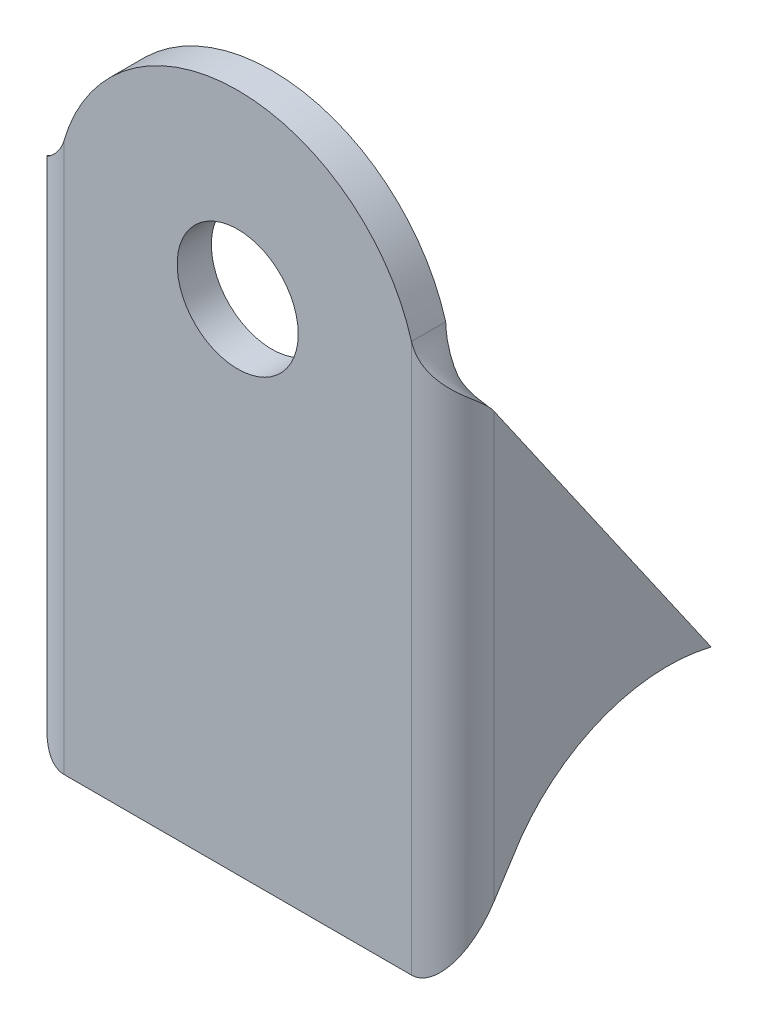
ISO-10303-21;
HEADER;
FILE_DESCRIPTION(('STEP AP214'),'2;1');
FILE_NAME('part.step','',(''),(''),'','','');
FILE_SCHEMA(('AUTOMOTIVE_DESIGN { 1 0 10303 214 1 1 1 1 }'));
ENDSEC;
DATA;
#1=APPLICATION_CONTEXT('core data for automotive mechanical design processes');
#2=APPLICATION_PROTOCOL_DEFINITION('international standard','automotive_design',2000,#1);
#3=PRODUCT_CONTEXT('',#1,'mechanical');
#4=PRODUCT('Part','Part','',(#3));
#5=PRODUCT_RELATED_PRODUCT_CATEGORY('part','',(#4));
#6=PRODUCT_DEFINITION_FORMATION('','',#4);
#7=PRODUCT_DEFINITION_CONTEXT('part definition',#1,'design');
#8=PRODUCT_DEFINITION('design','',#6,#7);
#9=PRODUCT_DEFINITION_SHAPE('','',#8);
#10=(LENGTH_UNIT() NAMED_UNIT(*) SI_UNIT(.MILLI.,.METRE.));
#11=(NAMED_UNIT(*) PLANE_ANGLE_UNIT() SI_UNIT($,.RADIAN.));
#12=(NAMED_UNIT(*) SI_UNIT($,.STERADIAN.) SOLID_ANGLE_UNIT());
#13=UNCERTAINTY_MEASURE_WITH_UNIT(LENGTH_MEASURE(1.E-05),#10,'distance_accuracy_value','');
#14=(GEOMETRIC_REPRESENTATION_CONTEXT(3) GLOBAL_UNCERTAINTY_ASSIGNED_CONTEXT((#13)) GLOBAL_UNIT_ASSIGNED_CONTEXT((#10,
#11,#12)) REPRESENTATION_CONTEXT('',''));
#15=CARTESIAN_POINT('',(0.,0.,0.));
#16=DIRECTION('',(0.,0.,1.));
#17=DIRECTION('',(1.,0.,0.));
#18=AXIS2_PLACEMENT_3D('',#15,#16,#17);
#19=CARTESIAN_POINT('',(0.,35.,15.1));
#20=DIRECTION('',(0.,0.,1.));
#21=DIRECTION('',(1.,0.,0.));
#22=AXIS2_PLACEMENT_3D('',#19,#20,#21);
#23=CYLINDRICAL_SURFACE('',#22,12.7);
#24=CARTESIAN_POINT('',(12.2,38.5284557528755,12.7));
#25=CARTESIAN_POINT('',(12.2,38.5284557528755,15.1));
#26=B_SPLINE_CURVE_WITH_KNOTS('',1,(#24,#25),.UNSPECIFIED.,.F.,.F.,(2,2),(0.,1.),.UNSPECIFIED.);
#27=CARTESIAN_POINT('',(12.2,38.5284557528755,12.7));
#28=VERTEX_POINT('',#27);
#29=CARTESIAN_POINT('',(12.2,38.5284557528755,15.1));
#30=VERTEX_POINT('',#29);
#31=EDGE_CURVE('E12',#28,#30,#26,.T.);
#32=ORIENTED_EDGE('',*,*,#31,.F.);
#33=CARTESIAN_POINT('',(0.,35.,12.7));
#34=DIRECTION('',(0.,0.,1.));
#35=DIRECTION('',(1.,0.,0.));
#36=AXIS2_PLACEMENT_3D('',#33,#34,#35);
#37=CIRCLE('',#36,12.7);
#38=CARTESIAN_POINT('',(-12.2,38.5284557528755,12.7));
#39=VERTEX_POINT('',#38);
#40=EDGE_CURVE('E105',#28,#39,#37,.T.);
#41=ORIENTED_EDGE('',*,*,#40,.T.);
#42=CARTESIAN_POINT('',(-12.2,38.5284557528755,15.1));
#43=CARTESIAN_POINT('',(-12.2,38.5284557528755,12.7));
#44=B_SPLINE_CURVE_WITH_KNOTS('',1,(#42,#43),.UNSPECIFIED.,.F.,.F.,(2,2),(0.,1.),.UNSPECIFIED.);
#45=CARTESIAN_POINT('',(-12.2,38.5284557528755,15.1));
#46=VERTEX_POINT('',#45);
#47=EDGE_CURVE('E56',#39,#46,#44,.F.);
#48=ORIENTED_EDGE('',*,*,#47,.T.);
#49=CARTESIAN_POINT('',(0.,35.,15.1));
#50=DIRECTION('',(0.,0.,1.));
#51=DIRECTION('',(-1.,0.,0.));
#52=AXIS2_PLACEMENT_3D('',#49,#50,#51);
#53=CIRCLE('',#52,12.7);
#54=EDGE_CURVE('E107',#30,#46,#53,.T.);
#55=ORIENTED_EDGE('',*,*,#54,.F.);
#56=EDGE_LOOP('',(#32,#41,#48,#55));
#57=FACE_BOUND('',#56,.T.);
#58=ADVANCED_FACE('F45',(#57),#23,.T.);
#59=CARTESIAN_POINT('',(-15.1,34.2798992341935,12.2));
#60=CARTESIAN_POINT('',(-15.1,34.4819461582793,12.3402907299088));
#61=CARTESIAN_POINT('',(-15.0896251809378,34.6704199315726,12.5085310570541));
#62=CARTESIAN_POINT('',(-15.0258753157223,35.0277931694172,12.8779039751087));
#63=CARTESIAN_POINT('',(-14.9722096248799,35.1967496451291,13.0789694076133));
#64=CARTESIAN_POINT('',(-14.8092263521637,35.5231163699395,13.4843952923347));
#65=CARTESIAN_POINT('',(-14.6997974551834,35.6805266190379,13.6884702876476));
#66=CARTESIAN_POINT('',(-14.4294183143129,35.9917149504285,14.0692846476547));
#67=CARTESIAN_POINT('',(-14.2685979653156,36.1454930327207,14.2457210777238));
#68=CARTESIAN_POINT('',(-13.9161941700124,36.4573310903059,14.5492019582757));
#69=CARTESIAN_POINT('',(-13.7249074025649,36.6153910655989,14.6761076228356));
#70=CARTESIAN_POINT('',(-13.3421307857591,36.943706968993,14.8743202527901));
#71=CARTESIAN_POINT('',(-13.1509263013254,37.1139628970942,14.9457318374617));
#72=CARTESIAN_POINT('',(-12.6233593866597,37.6548957003203,15.0920552285424));
#73=CARTESIAN_POINT('',(-12.3365990106616,38.0561505727088,15.1));
#74=CARTESIAN_POINT('',(-12.2,38.5284557528755,15.1));
#75=CARTESIAN_POINT('',(-12.7,34.2798992341935,12.2));
#76=CARTESIAN_POINT('',(-12.7,34.4820006931203,12.2241945855218));
#77=CARTESIAN_POINT('',(-12.6982112380927,34.6704199315726,12.2531950098369));
#78=CARTESIAN_POINT('',(-12.6872198820211,35.0277931694172,12.3168799957084));
#79=CARTESIAN_POINT('',(-12.6779671767034,35.1967496451291,12.3515464495885));
#80=CARTESIAN_POINT('',(-12.649866612442,35.5231163699395,12.4214474641956));
#81=CARTESIAN_POINT('',(-12.6309995612385,35.6805266190379,12.4566328082151));
#82=CARTESIAN_POINT('',(-12.584382467985,35.9917149504285,12.5222904564922));
#83=CARTESIAN_POINT('',(-12.5566548216061,36.1454930327207,12.552710530642));
#84=CARTESIAN_POINT('',(-12.4958955465539,36.4573310903059,12.6050348203924));
#85=CARTESIAN_POINT('',(-12.4629150694077,36.6153910655989,12.6269151073854));
#86=CARTESIAN_POINT('',(-12.3969191009929,36.943706968993,12.6610896987569));
#87=CARTESIAN_POINT('',(-12.3639528105733,37.1139628970942,12.6734020409417));
#88=CARTESIAN_POINT('',(-12.2729929976999,37.6548957003203,12.6986302118176));
#89=CARTESIAN_POINT('',(-12.2235714850513,38.0557508646616,12.7));
#90=CARTESIAN_POINT('',(-12.2,38.5284557528755,12.7));
#91=B_SPLINE_SURFACE_WITH_KNOTS('',1,3,((#59,#60,#61,#62,#63,#64,#65,#66,#67,#68,#69,#70,#71,
#72,#73,#74),(#75,#76,#77,#78,#79,#80,#81,#82,#83,#84,#85,#86,#87,#88,#89,#90)),.UNSPECIFIED.,
.F.,.F.,.F.,(2,2),(4,2,2,2,2,2,2,4),(0.,1.),(0.,0.125,0.25,0.375,0.5,0.625,0.75,1.),.UNSPECIFIED.);
#92=CARTESIAN_POINT('',(-12.2,38.5284557528755,12.7));
#93=CARTESIAN_POINT('',(-12.2235714850513,38.0557508646616,12.7));
#94=CARTESIAN_POINT('',(-12.2729929976999,37.6548957003203,12.6986302118176));
#95=CARTESIAN_POINT('',(-12.3639528105733,37.1139628970942,12.6734020409417));
#96=CARTESIAN_POINT('',(-12.3969191009929,36.943706968993,12.6610896987569));
#97=CARTESIAN_POINT('',(-12.4629150694077,36.6153910655989,12.6269151073854));
#98=CARTESIAN_POINT('',(-12.4958955465539,36.4573310903059,12.6050348203924));
#99=CARTESIAN_POINT('',(-12.5566548216061,36.1454930327207,12.552710530642));
#100=CARTESIAN_POINT('',(-12.584382467985,35.9917149504285,12.5222904564922));
#101=CARTESIAN_POINT('',(-12.6309995612385,35.6805266190379,12.4566328082151));
#102=CARTESIAN_POINT('',(-12.649866612442,35.5231163699395,12.4214474641956));
#103=CARTESIAN_POINT('',(-12.6779671767034,35.1967496451291,12.3515464495885));
#104=CARTESIAN_POINT('',(-12.6872198820211,35.0277931694172,12.3168799957084));
#105=CARTESIAN_POINT('',(-12.6982112380927,34.6704199315726,12.2531950098369));
#106=CARTESIAN_POINT('',(-12.7,34.4820006931203,12.2241945855218));
#107=CARTESIAN_POINT('',(-12.7,34.2798992341935,12.2));
#108=B_SPLINE_CURVE_WITH_KNOTS('',3,(#92,#93,#94,#95,#96,#97,#98,#99,#100,#101,#102,#103,#104,
#105,#106,#107),.UNSPECIFIED.,.F.,.F.,(4,2,2,2,2,2,2,4),(0.,0.25,0.375,0.5,0.625,0.75,0.875,1.),.UNSPECIFIED.);
#109=CARTESIAN_POINT('',(-12.7,34.2798992341935,12.2));
#110=VERTEX_POINT('',#109);
#111=EDGE_CURVE('E272',#39,#110,#108,.T.);
#112=CARTESIAN_POINT('',(-12.7,34.2798992341935,12.2));
#113=CARTESIAN_POINT('',(-15.1,34.2798992341935,12.2));
#114=B_SPLINE_CURVE_WITH_KNOTS('',1,(#112,#113),.UNSPECIFIED.,.F.,.F.,(2,2),(0.,1.),.UNSPECIFIED.);
#115=CARTESIAN_POINT('',(-15.1,34.2798992341935,12.2));
#116=VERTEX_POINT('',#115);
#117=EDGE_CURVE('E240',#110,#116,#114,.T.);
#118=CARTESIAN_POINT('',(-15.1,34.2798992341935,12.2));
#119=CARTESIAN_POINT('',(-15.1,34.4819461582793,12.3402907299088));
#120=CARTESIAN_POINT('',(-15.0896251809378,34.6704199315726,12.5085310570541));
#121=CARTESIAN_POINT('',(-15.0258753157223,35.0277931694172,12.8779039751087));
#122=CARTESIAN_POINT('',(-14.9722096248799,35.1967496451291,13.0789694076133));
#123=CARTESIAN_POINT('',(-14.8092263521637,35.5231163699395,13.4843952923347));
#124=CARTESIAN_POINT('',(-14.6997974551834,35.6805266190379,13.6884702876476));
#125=CARTESIAN_POINT('',(-14.4294183143129,35.9917149504285,14.0692846476547));
#126=CARTESIAN_POINT('',(-14.2685979653156,36.1454930327207,14.2457210777238));
#127=CARTESIAN_POINT('',(-13.9161941700124,36.4573310903059,14.5492019582757));
#128=CARTESIAN_POINT('',(-13.7249074025649,36.6153910655989,14.6761076228356));
#129=CARTESIAN_POINT('',(-13.3421307857591,36.943706968993,14.8743202527901));
#130=CARTESIAN_POINT('',(-13.1509263013254,37.1139628970942,14.9457318374617));
#131=CARTESIAN_POINT('',(-12.6233593866597,37.6548957003203,15.0920552285424));
#132=CARTESIAN_POINT('',(-12.3365990106616,38.0561505727088,15.1));
#133=CARTESIAN_POINT('',(-12.2,38.5284557528755,15.1));
#134=B_SPLINE_CURVE_WITH_KNOTS('',3,(#118,#119,#120,#121,#122,#123,#124,#125,#126,#127,#128,
#129,#130,#131,#132,#133),.UNSPECIFIED.,.F.,.F.,(4,2,2,2,2,2,2,4),(0.,0.125,0.25,0.375,0.5,
0.625,0.75,1.),.UNSPECIFIED.);
#135=EDGE_CURVE('E336',#46,#116,#134,.F.);
#136=ORIENTED_EDGE('',*,*,#47,.F.);
#137=ORIENTED_EDGE('',*,*,#111,.T.);
#138=ORIENTED_EDGE('',*,*,#117,.T.);
#139=ORIENTED_EDGE('',*,*,#135,.F.);
#140=EDGE_LOOP('',(#136,#137,#138,#139));
#141=FACE_BOUND('',#140,.T.);
#142=ADVANCED_FACE('F193',(#141),#91,.F.);
#143=CARTESIAN_POINT('',(-15.1,35.,12.7));
#144=DIRECTION('',(0.,0.570341957284981,-0.821407360424982));
#145=DIRECTION('',(0.,-0.821407360424982,-0.570341957284981));
#146=AXIS2_PLACEMENT_3D('',#143,#144,#145);
#147=PLANE('',#146);
#148=ORIENTED_EDGE('',*,*,#117,.F.);
#149=DIRECTION('',(0.,-0.821407360424982,-0.570341957284981));
#150=VECTOR('',#149,1.);
#151=CARTESIAN_POINT('',(-12.7,35.,12.7));
#152=LINE('',#151,#150);
#153=CARTESIAN_POINT('',(-12.7,12.3307004309584,-3.04036624141937));
#154=VERTEX_POINT('',#153);
#155=EDGE_CURVE('E258',#110,#154,#152,.T.);
#156=ORIENTED_EDGE('',*,*,#155,.T.);
#157=DIRECTION('',(-1.,0.,0.));
#158=VECTOR('',#157,1.);
#159=CARTESIAN_POINT('',(-15.1,12.3307004309584,-3.04036624141937));
#160=LINE('',#159,#158);
#161=CARTESIAN_POINT('',(-15.1,12.3307004309584,-3.04036624141937));
#162=VERTEX_POINT('',#161);
#163=EDGE_CURVE('E266',#154,#162,#160,.T.);
#164=ORIENTED_EDGE('',*,*,#163,.T.);
#165=DIRECTION('',(0.,-0.821407360424982,-0.570341957284981));
#166=VECTOR('',#165,1.);
#167=CARTESIAN_POINT('',(-15.1,35.,12.7));
#168=LINE('',#167,#166);
#169=EDGE_CURVE('E261',#116,#162,#168,.T.);
#170=ORIENTED_EDGE('',*,*,#169,.F.);
#171=EDGE_LOOP('',(#148,#156,#164,#170));
#172=FACE_BOUND('',#171,.T.);
#173=ADVANCED_FACE('F204',(#172),#147,.T.);
#174=CARTESIAN_POINT('',(-15.1,0.,0.));
#175=DIRECTION('',(1.,0.,0.));
#176=DIRECTION('',(0.,0.,-1.));
#177=AXIS2_PLACEMENT_3D('',#174,#175,#176);
#178=CYLINDRICAL_SURFACE('',#177,12.7);
#179=ORIENTED_EDGE('',*,*,#163,.F.);
#180=CARTESIAN_POINT('',(-12.7,0.,0.));
#181=DIRECTION('',(1.,0.,0.));
#182=DIRECTION('',(0.,0.,-1.));
#183=AXIS2_PLACEMENT_3D('',#180,#181,#182);
#184=CIRCLE('',#183,12.7);
#185=CARTESIAN_POINT('',(-12.7,7.42967024840268,10.3));
#186=VERTEX_POINT('',#185);
#187=EDGE_CURVE('E282',#154,#186,#184,.T.);
#188=ORIENTED_EDGE('',*,*,#187,.T.);
#189=DIRECTION('',(-1.,0.,0.));
#190=VECTOR('',#189,1.);
#191=CARTESIAN_POINT('',(-15.1,7.42967024840268,10.3));
#192=LINE('',#191,#190);
#193=CARTESIAN_POINT('',(-15.1,7.42967024840268,10.3));
#194=VERTEX_POINT('',#193);
#195=EDGE_CURVE('E411',#186,#194,#192,.T.);
#196=ORIENTED_EDGE('',*,*,#195,.T.);
#197=CARTESIAN_POINT('',(-15.1,0.,0.));
#198=DIRECTION('',(1.,0.,0.));
#199=DIRECTION('',(0.,0.,1.));
#200=AXIS2_PLACEMENT_3D('',#197,#198,#199);
#201=CIRCLE('',#200,12.7);
#202=EDGE_CURVE('E366',#162,#194,#201,.T.);
#203=ORIENTED_EDGE('',*,*,#202,.F.);
#204=EDGE_LOOP('',(#179,#188,#196,#203));
#205=FACE_BOUND('',#204,.T.);
#206=ADVANCED_FACE('F418',(#205),#178,.F.);
#207=CARTESIAN_POINT('',(-15.1,0.,15.1));
#208=DIRECTION('',(0.,-0.542658757975361,-0.839953256075978));
#209=DIRECTION('',(0.,-0.839953256075978,0.542658757975361));
#210=AXIS2_PLACEMENT_3D('',#207,#208,#209);
#211=PLANE('',#210);
#212=ORIENTED_EDGE('',*,*,#195,.F.);
#213=DIRECTION('',(0.,-0.839953256075978,0.542658757975361));
#214=VECTOR('',#213,1.);
#215=CARTESIAN_POINT('',(-12.7,0.,15.1));
#216=LINE('',#215,#214);
#217=CARTESIAN_POINT('',(-12.7,4.48875910840996,12.2));
#218=VERTEX_POINT('',#217);
#219=EDGE_CURVE('E141',#186,#218,#216,.T.);
#220=ORIENTED_EDGE('',*,*,#219,.T.);
#221=DIRECTION('',(-1.,0.,0.));
#222=VECTOR('',#221,1.);
#223=CARTESIAN_POINT('',(-15.1,4.48875910840996,12.2));
#224=LINE('',#223,#222);
#225=CARTESIAN_POINT('',(-15.1,4.48875910840996,12.2));
#226=VERTEX_POINT('',#225);
#227=EDGE_CURVE('E404',#218,#226,#224,.T.);
#228=ORIENTED_EDGE('',*,*,#227,.T.);
#229=DIRECTION('',(0.,-0.839953256075978,0.542658757975361));
#230=VECTOR('',#229,1.);
#231=CARTESIAN_POINT('',(-15.1,0.,15.1));
#232=LINE('',#231,#230);
#233=EDGE_CURVE('E359',#194,#226,#232,.T.);
#234=ORIENTED_EDGE('',*,*,#233,.F.);
#235=EDGE_LOOP('',(#212,#220,#228,#234));
#236=FACE_BOUND('',#235,.T.);
#237=ADVANCED_FACE('F422',(#236),#211,.T.);
#238=CARTESIAN_POINT('',(-12.2,0.,15.1));
#239=CARTESIAN_POINT('',(-12.2,0.,14.3));
#240=CARTESIAN_POINT('',(-12.2,0.,13.5));
#241=CARTESIAN_POINT('',(-12.2,0.,12.7));
#242=CARTESIAN_POINT('',(-6.4,0.,15.1));
#243=CARTESIAN_POINT('',(-8.,0.,14.3));
#244=CARTESIAN_POINT('',(-9.6,0.,13.5));
#245=CARTESIAN_POINT('',(-11.2,0.,12.7));
#246=CARTESIAN_POINT('',(-6.4,8.97751821681992,9.3));
#247=CARTESIAN_POINT('',(-8.,8.97751821681992,10.1));
#248=CARTESIAN_POINT('',(-9.6,8.97751821681992,10.9));
#249=CARTESIAN_POINT('',(-11.2,8.97751821681992,11.7));
#250=CARTESIAN_POINT('',(-12.2,8.97751821681992,9.3));
#251=CARTESIAN_POINT('',(-12.2,8.97751821681992,10.1));
#252=CARTESIAN_POINT('',(-12.2,8.97751821681992,10.9));
#253=CARTESIAN_POINT('',(-12.2,8.97751821681992,11.7));
#254=CARTESIAN_POINT('',(-18.,8.97751821681992,9.3));
#255=CARTESIAN_POINT('',(-16.4,8.97751821681992,10.1));
#256=CARTESIAN_POINT('',(-14.8,8.97751821681992,10.9));
#257=CARTESIAN_POINT('',(-13.2,8.97751821681992,11.7));
#258=CARTESIAN_POINT('',(-18.,0.,15.1));
#259=CARTESIAN_POINT('',(-16.4,0.,14.3));
#260=CARTESIAN_POINT('',(-14.8,0.,13.5));
#261=CARTESIAN_POINT('',(-13.2,0.,12.7));
#262=CARTESIAN_POINT('',(-12.2,0.,15.1));
#263=CARTESIAN_POINT('',(-12.2,0.,14.3));
#264=CARTESIAN_POINT('',(-12.2,0.,13.5));
#265=CARTESIAN_POINT('',(-12.2,0.,12.7));
#266=(BOUNDED_SURFACE() B_SPLINE_SURFACE(3,3,((#238,#239,#240,#241),(#242,#243,#244,#245),(#246,
#247,#248,#249),(#250,#251,#252,#253),(#254,#255,#256,#257),(#258,#259,#260,#261),(#262,#263,
#264,#265)),.UNSPECIFIED.,.T.,.F.,.F.) B_SPLINE_SURFACE_WITH_KNOTS((4,3,4),(4,4),(0.,0.5,1.),
(0.,1.),.UNSPECIFIED.) GEOMETRIC_REPRESENTATION_ITEM() RATIONAL_B_SPLINE_SURFACE(((1.,1.,1.,1.),
(0.333333333333333,0.333333333333333,0.333333333333333,0.333333333333333),(0.333333333333333,
0.333333333333333,0.333333333333333,0.333333333333333),(1.,1.,1.,1.),(0.333333333333333,
0.333333333333333,0.333333333333333,0.333333333333333),(0.333333333333333,0.333333333333333,
0.333333333333333,0.333333333333333),(1.,1.,1.,1.))) REPRESENTATION_ITEM('') SURFACE());
#267=CARTESIAN_POINT('',(-12.2,4.48875910840996,12.2));
#268=DIRECTION('',(0.,-0.110704687135026,-0.993853345442041));
#269=DIRECTION('',(0.,-0.993853345442041,0.110704687135026));
#270=AXIS2_PLACEMENT_3D('',#267,#268,#269);
#271=ELLIPSE('',#270,4.51652060034418,0.5);
#272=CARTESIAN_POINT('',(-12.2,0.,12.7));
#273=VERTEX_POINT('',#272);
#274=EDGE_CURVE('E149',#218,#273,#271,.F.);
#275=DIRECTION('',(0.,0.,1.));
#276=VECTOR('',#275,1.);
#277=CARTESIAN_POINT('',(-12.2,0.,15.1));
#278=LINE('',#277,#276);
#279=CARTESIAN_POINT('',(-12.2,0.,15.1));
#280=VERTEX_POINT('',#279);
#281=EDGE_CURVE('E402',#273,#280,#278,.T.);
#282=CARTESIAN_POINT('',(-12.2,4.48875910840996,12.2));
#283=DIRECTION('',(0.,-0.542658757975361,-0.839953256075978));
#284=DIRECTION('',(0.,-0.839953256075978,0.542658757975361));
#285=AXIS2_PLACEMENT_3D('',#282,#283,#284);
#286=ELLIPSE('',#285,5.3440582269782,2.9);
#287=EDGE_CURVE('E342',#226,#280,#286,.F.);
#288=ORIENTED_EDGE('',*,*,#227,.F.);
#289=ORIENTED_EDGE('',*,*,#274,.T.);
#290=ORIENTED_EDGE('',*,*,#281,.T.);
#291=ORIENTED_EDGE('',*,*,#287,.F.);
#292=EDGE_LOOP('',(#288,#289,#290,#291));
#293=FACE_BOUND('',#292,.T.);
#294=ADVANCED_FACE('F423',(#293),#266,.F.);
#295=CARTESIAN_POINT('',(-12.7,0.,15.1));
#296=DIRECTION('',(0.,1.,0.));
#297=DIRECTION('',(1.,0.,0.));
#298=AXIS2_PLACEMENT_3D('',#295,#296,#297);
#299=PLANE('',#298);
#300=ORIENTED_EDGE('',*,*,#281,.F.);
#301=DIRECTION('',(-1.,0.,0.));
#302=VECTOR('',#301,1.);
#303=CARTESIAN_POINT('',(0.,0.,12.7));
#304=LINE('',#303,#302);
#305=CARTESIAN_POINT('',(12.2,0.,12.7));
#306=VERTEX_POINT('',#305);
#307=EDGE_CURVE('E140',#273,#306,#304,.F.);
#308=ORIENTED_EDGE('',*,*,#307,.T.);
#309=DIRECTION('',(0.,0.,1.));
#310=VECTOR('',#309,1.);
#311=CARTESIAN_POINT('',(12.2,0.,15.1));
#312=LINE('',#311,#310);
#313=CARTESIAN_POINT('',(12.2,0.,15.1));
#314=VERTEX_POINT('',#313);
#315=EDGE_CURVE('E398',#306,#314,#312,.T.);
#316=ORIENTED_EDGE('',*,*,#315,.T.);
#317=DIRECTION('',(1.,0.,0.));
#318=VECTOR('',#317,1.);
#319=CARTESIAN_POINT('',(-12.7,0.,15.1));
#320=LINE('',#319,#318);
#321=EDGE_CURVE('E358',#280,#314,#320,.T.);
#322=ORIENTED_EDGE('',*,*,#321,.F.);
#323=EDGE_LOOP('',(#300,#308,#316,#322));
#324=FACE_BOUND('',#323,.T.);
#325=ADVANCED_FACE('F424',(#324),#299,.F.);
#326=CARTESIAN_POINT('',(12.2,0.,12.7));
#327=CARTESIAN_POINT('',(12.2,0.,13.5));
#328=CARTESIAN_POINT('',(12.2,0.,14.3));
#329=CARTESIAN_POINT('',(12.2,0.,15.1));
#330=CARTESIAN_POINT('',(13.2,0.,12.7));
#331=CARTESIAN_POINT('',(14.8,0.,13.5));
#332=CARTESIAN_POINT('',(16.4,0.,14.3));
#333=CARTESIAN_POINT('',(18.,0.,15.1));
#334=CARTESIAN_POINT('',(13.2,8.97751821681991,11.7));
#335=CARTESIAN_POINT('',(14.8,8.97751821681992,10.9));
#336=CARTESIAN_POINT('',(16.4,8.97751821681992,10.1));
#337=CARTESIAN_POINT('',(18.,8.97751821681992,9.3));
#338=CARTESIAN_POINT('',(12.2,8.97751821681991,11.7));
#339=CARTESIAN_POINT('',(12.2,8.97751821681991,10.9));
#340=CARTESIAN_POINT('',(12.2,8.97751821681992,10.1));
#341=CARTESIAN_POINT('',(12.2,8.97751821681992,9.3));
#342=CARTESIAN_POINT('',(11.2,8.97751821681992,11.7));
#343=CARTESIAN_POINT('',(9.6,8.97751821681992,10.9));
#344=CARTESIAN_POINT('',(8.,8.97751821681992,10.1));
#345=CARTESIAN_POINT('',(6.4,8.97751821681992,9.3));
#346=CARTESIAN_POINT('',(11.2,0.,12.7));
#347=CARTESIAN_POINT('',(9.6,0.,13.5));
#348=CARTESIAN_POINT('',(8.,0.,14.3));
#349=CARTESIAN_POINT('',(6.4,0.,15.1));
#350=CARTESIAN_POINT('',(12.2,0.,12.7));
#351=CARTESIAN_POINT('',(12.2,0.,13.5));
#352=CARTESIAN_POINT('',(12.2,0.,14.3));
#353=CARTESIAN_POINT('',(12.2,0.,15.1));
#354=(BOUNDED_SURFACE() B_SPLINE_SURFACE(3,3,((#326,#327,#328,#329),(#330,#331,#332,#333),(#334,
#335,#336,#337),(#338,#339,#340,#341),(#342,#343,#344,#345),(#346,#347,#348,#349),(#350,#351,
#352,#353)),.UNSPECIFIED.,.T.,.F.,.F.) B_SPLINE_SURFACE_WITH_KNOTS((4,3,4),(4,4),(0.,0.5,1.),
(0.,1.),.UNSPECIFIED.) GEOMETRIC_REPRESENTATION_ITEM() RATIONAL_B_SPLINE_SURFACE(((1.,1.,1.,1.),
(0.333333333333333,0.333333333333333,0.333333333333333,0.333333333333333),(0.333333333333333,
0.333333333333333,0.333333333333333,0.333333333333333),(1.,1.,1.,1.),(0.333333333333333,
0.333333333333333,0.333333333333333,0.333333333333333),(0.333333333333333,0.333333333333333,
0.333333333333333,0.333333333333333),(1.,1.,1.,1.))) REPRESENTATION_ITEM('') SURFACE());
#355=CARTESIAN_POINT('',(12.2,4.48875910840996,12.2));
#356=DIRECTION('',(0.,0.110704687135026,0.993853345442041));
#357=DIRECTION('',(0.,-0.993853345442041,0.110704687135026));
#358=AXIS2_PLACEMENT_3D('',#355,#356,#357);
#359=ELLIPSE('',#358,4.51652060034418,0.5);
#360=CARTESIAN_POINT('',(12.7,4.48875910840996,12.2));
#361=VERTEX_POINT('',#360);
#362=EDGE_CURVE('E127',#306,#361,#359,.T.);
#363=DIRECTION('',(1.,0.,0.));
#364=VECTOR('',#363,1.);
#365=CARTESIAN_POINT('',(15.1,4.48875910840996,12.2));
#366=LINE('',#365,#364);
#367=CARTESIAN_POINT('',(15.1,4.48875910840996,12.2));
#368=VERTEX_POINT('',#367);
#369=EDGE_CURVE('E396',#361,#368,#366,.T.);
#370=CARTESIAN_POINT('',(12.2,4.48875910840996,12.2));
#371=DIRECTION('',(0.,0.542658757975361,0.839953256075978));
#372=DIRECTION('',(0.,-0.839953256075978,0.542658757975361));
#373=AXIS2_PLACEMENT_3D('',#370,#371,#372);
#374=ELLIPSE('',#373,5.3440582269782,2.9);
#375=EDGE_CURVE('E382',#314,#368,#374,.T.);
#376=ORIENTED_EDGE('',*,*,#315,.F.);
#377=ORIENTED_EDGE('',*,*,#362,.T.);
#378=ORIENTED_EDGE('',*,*,#369,.T.);
#379=ORIENTED_EDGE('',*,*,#375,.F.);
#380=EDGE_LOOP('',(#376,#377,#378,#379));
#381=FACE_BOUND('',#380,.T.);
#382=ADVANCED_FACE('F393',(#381),#354,.T.);
#383=CARTESIAN_POINT('',(15.1,0.,15.1));
#384=DIRECTION('',(0.,0.542658757975361,0.839953256075978));
#385=DIRECTION('',(0.,-0.839953256075978,0.542658757975361));
#386=AXIS2_PLACEMENT_3D('',#383,#384,#385);
#387=PLANE('',#386);
#388=ORIENTED_EDGE('',*,*,#369,.F.);
#389=DIRECTION('',(0.,-0.839953256075978,0.542658757975361));
#390=VECTOR('',#389,1.);
#391=CARTESIAN_POINT('',(12.7,0.,15.1));
#392=LINE('',#391,#390);
#393=CARTESIAN_POINT('',(12.7,7.42967024840268,10.3));
#394=VERTEX_POINT('',#393);
#395=EDGE_CURVE('E293',#394,#361,#392,.T.);
#396=ORIENTED_EDGE('',*,*,#395,.F.);
#397=DIRECTION('',(1.,0.,0.));
#398=VECTOR('',#397,1.);
#399=CARTESIAN_POINT('',(15.1,7.42967024840268,10.3));
#400=LINE('',#399,#398);
#401=CARTESIAN_POINT('',(15.1,7.42967024840268,10.3));
#402=VERTEX_POINT('',#401);
#403=EDGE_CURVE('E406',#394,#402,#400,.T.);
#404=ORIENTED_EDGE('',*,*,#403,.T.);
#405=DIRECTION('',(0.,-0.839953256075978,0.542658757975361));
#406=VECTOR('',#405,1.);
#407=CARTESIAN_POINT('',(15.1,0.,15.1));
#408=LINE('',#407,#406);
#409=EDGE_CURVE('E375',#402,#368,#408,.T.);
#410=ORIENTED_EDGE('',*,*,#409,.T.);
#411=EDGE_LOOP('',(#388,#396,#404,#410));
#412=FACE_BOUND('',#411,.T.);
#413=ADVANCED_FACE('F476',(#412),#387,.F.);
#414=CARTESIAN_POINT('',(15.1,0.,0.));
#415=DIRECTION('',(1.,0.,0.));
#416=DIRECTION('',(0.,0.,-1.));
#417=AXIS2_PLACEMENT_3D('',#414,#415,#416);
#418=CYLINDRICAL_SURFACE('',#417,12.7);
#419=ORIENTED_EDGE('',*,*,#403,.F.);
#420=CARTESIAN_POINT('',(12.7,0.,0.));
#421=DIRECTION('',(1.,0.,0.));
#422=DIRECTION('',(0.,0.,-1.));
#423=AXIS2_PLACEMENT_3D('',#420,#421,#422);
#424=CIRCLE('',#423,12.7);
#425=CARTESIAN_POINT('',(12.7,12.3307004309584,-3.04036624141937));
#426=VERTEX_POINT('',#425);
#427=EDGE_CURVE('E387',#426,#394,#424,.T.);
#428=ORIENTED_EDGE('',*,*,#427,.F.);
#429=DIRECTION('',(1.,0.,0.));
#430=VECTOR('',#429,1.);
#431=CARTESIAN_POINT('',(15.1,12.3307004309584,-3.04036624141937));
#432=LINE('',#431,#430);
#433=CARTESIAN_POINT('',(15.1,12.3307004309584,-3.04036624141937));
#434=VERTEX_POINT('',#433);
#435=EDGE_CURVE('E158',#426,#434,#432,.T.);
#436=ORIENTED_EDGE('',*,*,#435,.T.);
#437=CARTESIAN_POINT('',(15.1,0.,0.));
#438=DIRECTION('',(1.,0.,0.));
#439=DIRECTION('',(0.,0.,1.));
#440=AXIS2_PLACEMENT_3D('',#437,#438,#439);
#441=CIRCLE('',#440,12.7);
#442=EDGE_CURVE('E378',#434,#402,#441,.T.);
#443=ORIENTED_EDGE('',*,*,#442,.T.);
#444=EDGE_LOOP('',(#419,#428,#436,#443));
#445=FACE_BOUND('',#444,.T.);
#446=ADVANCED_FACE('F480',(#445),#418,.F.);
#447=CARTESIAN_POINT('',(15.1,35.,12.7));
#448=DIRECTION('',(0.,-0.570341957284981,0.821407360424982));
#449=DIRECTION('',(0.,-0.821407360424982,-0.570341957284981));
#450=AXIS2_PLACEMENT_3D('',#447,#448,#449);
#451=PLANE('',#450);
#452=ORIENTED_EDGE('',*,*,#435,.F.);
#453=DIRECTION('',(0.,-0.821407360424982,-0.570341957284981));
#454=VECTOR('',#453,1.);
#455=CARTESIAN_POINT('',(12.7,35.,12.7));
#456=LINE('',#455,#454);
#457=CARTESIAN_POINT('',(12.7,34.2798992341935,12.2));
#458=VERTEX_POINT('',#457);
#459=EDGE_CURVE('E132',#458,#426,#456,.T.);
#460=ORIENTED_EDGE('',*,*,#459,.F.);
#461=CARTESIAN_POINT('',(15.1,34.2798992341935,12.2));
#462=CARTESIAN_POINT('',(12.7,34.2798992341935,12.2));
#463=B_SPLINE_CURVE_WITH_KNOTS('',1,(#461,#462),.UNSPECIFIED.,.F.,.F.,(2,2),(0.,1.),.UNSPECIFIED.);
#464=CARTESIAN_POINT('',(15.1,34.2798992341935,12.2));
#465=VERTEX_POINT('',#464);
#466=EDGE_CURVE('E147',#458,#465,#463,.F.);
#467=ORIENTED_EDGE('',*,*,#466,.T.);
#468=DIRECTION('',(0.,-0.821407360424982,-0.570341957284981));
#469=VECTOR('',#468,1.);
#470=CARTESIAN_POINT('',(15.1,35.,12.7));
#471=LINE('',#470,#469);
#472=EDGE_CURVE('E381',#465,#434,#471,.T.);
#473=ORIENTED_EDGE('',*,*,#472,.T.);
#474=EDGE_LOOP('',(#452,#460,#467,#473));
#475=FACE_BOUND('',#474,.T.);
#476=ADVANCED_FACE('F439',(#475),#451,.F.);
#477=CARTESIAN_POINT('',(0.,35.,15.1));
#478=DIRECTION('',(0.,0.,1.));
#479=DIRECTION('',(1.,0.,0.));
#480=AXIS2_PLACEMENT_3D('',#477,#478,#479);
#481=CYLINDRICAL_SURFACE('',#480,4.25);
#482=CARTESIAN_POINT('',(0.,35.,15.1));
#483=DIRECTION('',(0.,0.,1.));
#484=DIRECTION('',(1.,0.,0.));
#485=AXIS2_PLACEMENT_3D('',#482,#483,#484);
#486=CIRCLE('',#485,4.25);
#487=CARTESIAN_POINT('',(4.25,35.,15.1));
#488=VERTEX_POINT('',#487);
#489=EDGE_CURVE('E363',#488,#488,#486,.T.);
#490=ORIENTED_EDGE('',*,*,#489,.T.);
#491=EDGE_LOOP('',(#490));
#492=FACE_BOUND('',#491,.T.);
#493=CARTESIAN_POINT('',(0.,35.,12.7));
#494=DIRECTION('',(0.,0.,1.));
#495=DIRECTION('',(1.,0.,0.));
#496=AXIS2_PLACEMENT_3D('',#493,#494,#495);
#497=CIRCLE('',#496,4.25);
#498=CARTESIAN_POINT('',(4.25,35.,12.7));
#499=VERTEX_POINT('',#498);
#500=EDGE_CURVE('E291',#499,#499,#497,.T.);
#501=ORIENTED_EDGE('',*,*,#500,.F.);
#502=EDGE_LOOP('',(#501));
#503=FACE_BOUND('',#502,.T.);
#504=ADVANCED_FACE('F47',(#492,#503),#481,.F.);
#505=CARTESIAN_POINT('',(12.2,38.5284557528755,15.1));
#506=CARTESIAN_POINT('',(12.3365990106616,38.0561505727088,15.1));
#507=CARTESIAN_POINT('',(12.6233593866597,37.6548957003203,15.0920552285424));
#508=CARTESIAN_POINT('',(13.1509263013254,37.1139628970942,14.9457318374617));
#509=CARTESIAN_POINT('',(13.3421307857591,36.9437069689931,14.8743202527901));
#510=CARTESIAN_POINT('',(13.7249074025649,36.6153910655989,14.6761076228356));
#511=CARTESIAN_POINT('',(13.9161941700124,36.4573310903059,14.5492019582757));
#512=CARTESIAN_POINT('',(14.2685979653156,36.1454930327207,14.2457210777238));
#513=CARTESIAN_POINT('',(14.4294183143129,35.9917149504285,14.0692846476547));
#514=CARTESIAN_POINT('',(14.6997974551834,35.6805266190379,13.6884702876476));
#515=CARTESIAN_POINT('',(14.8092263521637,35.5231163699395,13.4843952923347));
#516=CARTESIAN_POINT('',(14.9722096248799,35.1967496451291,13.0789694076133));
#517=CARTESIAN_POINT('',(15.0258753157223,35.0277931694172,12.8779039751087));
#518=CARTESIAN_POINT('',(15.0896251809378,34.6704199315726,12.5085310570541));
#519=CARTESIAN_POINT('',(15.1,34.4819461582793,12.3402907299088));
#520=CARTESIAN_POINT('',(15.1,34.2798992341935,12.2));
#521=CARTESIAN_POINT('',(12.2,38.5284557528755,12.7));
#522=CARTESIAN_POINT('',(12.2235714850513,38.0557508646616,12.7));
#523=CARTESIAN_POINT('',(12.2729929976999,37.6548957003203,12.6986302118176));
#524=CARTESIAN_POINT('',(12.3639528105733,37.1139628970942,12.6734020409417));
#525=CARTESIAN_POINT('',(12.3969191009929,36.9437069689931,12.6610896987569));
#526=CARTESIAN_POINT('',(12.4629150694077,36.6153910655989,12.6269151073854));
#527=CARTESIAN_POINT('',(12.4958955465539,36.4573310903059,12.6050348203924));
#528=CARTESIAN_POINT('',(12.5566548216061,36.1454930327207,12.552710530642));
#529=CARTESIAN_POINT('',(12.584382467985,35.9917149504285,12.5222904564922));
#530=CARTESIAN_POINT('',(12.6309995612385,35.6805266190379,12.4566328082151));
#531=CARTESIAN_POINT('',(12.649866612442,35.5231163699395,12.4214474641956));
#532=CARTESIAN_POINT('',(12.6779671767034,35.1967496451291,12.3515464495885));
#533=CARTESIAN_POINT('',(12.6872198820211,35.0277931694172,12.3168799957084));
#534=CARTESIAN_POINT('',(12.6982112380927,34.6704199315726,12.2531950098369));
#535=CARTESIAN_POINT('',(12.7,34.4820006931203,12.2241945855218));
#536=CARTESIAN_POINT('',(12.7,34.2798992341935,12.2));
#537=B_SPLINE_SURFACE_WITH_KNOTS('',1,3,((#505,#506,#507,#508,#509,#510,#511,#512,#513,#514,
#515,#516,#517,#518,#519,#520),(#521,#522,#523,#524,#525,#526,#527,#528,#529,#530,#531,#532,
#533,#534,#535,#536)),.UNSPECIFIED.,.F.,.F.,.F.,(2,2),(4,2,2,2,2,2,2,4),(0.,1.),(0.,0.25,0.375,
0.5,0.625,0.75,0.875,1.),.UNSPECIFIED.);
#538=CARTESIAN_POINT('',(12.7,34.2798992341935,12.2));
#539=CARTESIAN_POINT('',(12.7,34.4820006931203,12.2241945855218));
#540=CARTESIAN_POINT('',(12.6982112380927,34.6704199315726,12.2531950098369));
#541=CARTESIAN_POINT('',(12.6872198820211,35.0277931694172,12.3168799957084));
#542=CARTESIAN_POINT('',(12.6779671767034,35.1967496451291,12.3515464495885));
#543=CARTESIAN_POINT('',(12.649866612442,35.5231163699395,12.4214474641956));
#544=CARTESIAN_POINT('',(12.6309995612385,35.6805266190379,12.4566328082151));
#545=CARTESIAN_POINT('',(12.584382467985,35.9917149504285,12.5222904564922));
#546=CARTESIAN_POINT('',(12.5566548216061,36.1454930327207,12.552710530642));
#547=CARTESIAN_POINT('',(12.4958955465539,36.4573310903059,12.6050348203924));
#548=CARTESIAN_POINT('',(12.4629150694077,36.6153910655989,12.6269151073854));
#549=CARTESIAN_POINT('',(12.3969191009929,36.9437069689931,12.6610896987569));
#550=CARTESIAN_POINT('',(12.3639528105733,37.1139628970942,12.6734020409417));
#551=CARTESIAN_POINT('',(12.2729929976999,37.6548957003203,12.6986302118176));
#552=CARTESIAN_POINT('',(12.2235714850513,38.0557508646616,12.7));
#553=CARTESIAN_POINT('',(12.2,38.5284557528755,12.7));
#554=B_SPLINE_CURVE_WITH_KNOTS('',3,(#538,#539,#540,#541,#542,#543,#544,#545,#546,#547,#548,
#549,#550,#551,#552,#553),.UNSPECIFIED.,.F.,.F.,(4,2,2,2,2,2,2,4),(0.,0.125,0.25,0.375,0.5,
0.625,0.75,1.),.UNSPECIFIED.);
#555=EDGE_CURVE('E123',#458,#28,#554,.T.);
#556=CARTESIAN_POINT('',(12.2,38.5284557528755,15.1));
#557=CARTESIAN_POINT('',(12.3365990106616,38.0561505727088,15.1));
#558=CARTESIAN_POINT('',(12.6233593866597,37.6548957003203,15.0920552285424));
#559=CARTESIAN_POINT('',(13.1509263013254,37.1139628970942,14.9457318374617));
#560=CARTESIAN_POINT('',(13.3421307857591,36.9437069689931,14.8743202527901));
#561=CARTESIAN_POINT('',(13.7249074025649,36.6153910655989,14.6761076228356));
#562=CARTESIAN_POINT('',(13.9161941700124,36.4573310903059,14.5492019582757));
#563=CARTESIAN_POINT('',(14.2685979653156,36.1454930327207,14.2457210777238));
#564=CARTESIAN_POINT('',(14.4294183143129,35.9917149504285,14.0692846476547));
#565=CARTESIAN_POINT('',(14.6997974551834,35.6805266190379,13.6884702876476));
#566=CARTESIAN_POINT('',(14.8092263521637,35.5231163699395,13.4843952923347));
#567=CARTESIAN_POINT('',(14.9722096248799,35.1967496451291,13.0789694076133));
#568=CARTESIAN_POINT('',(15.0258753157223,35.0277931694172,12.8779039751087));
#569=CARTESIAN_POINT('',(15.0896251809378,34.6704199315726,12.5085310570541));
#570=CARTESIAN_POINT('',(15.1,34.4819461582793,12.3402907299088));
#571=CARTESIAN_POINT('',(15.1,34.2798992341935,12.2));
#572=B_SPLINE_CURVE_WITH_KNOTS('',3,(#556,#557,#558,#559,#560,#561,#562,#563,#564,#565,#566,
#567,#568,#569,#570,#571),.UNSPECIFIED.,.F.,.F.,(4,2,2,2,2,2,2,4),(0.,0.25,0.375,0.5,0.625,0.75,
0.875,1.),.UNSPECIFIED.);
#573=EDGE_CURVE('E385',#465,#30,#572,.F.);
#574=ORIENTED_EDGE('',*,*,#555,.T.);
#575=ORIENTED_EDGE('',*,*,#31,.T.);
#576=ORIENTED_EDGE('',*,*,#573,.F.);
#577=ORIENTED_EDGE('',*,*,#466,.F.);
#578=EDGE_LOOP('',(#574,#575,#576,#577));
#579=FACE_BOUND('',#578,.T.);
#580=ADVANCED_FACE('F145',(#579),#537,.F.);
#581=CARTESIAN_POINT('',(15.1,0.,0.));
#582=DIRECTION('',(1.,0.,0.));
#583=DIRECTION('',(0.,0.,1.));
#584=AXIS2_PLACEMENT_3D('',#581,#582,#583);
#585=PLANE('',#584);
#586=ORIENTED_EDGE('',*,*,#472,.F.);
#587=DIRECTION('',(0.,1.,0.));
#588=VECTOR('',#587,1.);
#589=CARTESIAN_POINT('',(15.1,0.,12.2));
#590=LINE('',#589,#588);
#591=EDGE_CURVE('E352',#465,#368,#590,.F.);
#592=ORIENTED_EDGE('',*,*,#591,.T.);
#593=ORIENTED_EDGE('',*,*,#409,.F.);
#594=ORIENTED_EDGE('',*,*,#442,.F.);
#595=EDGE_LOOP('',(#586,#592,#593,#594));
#596=FACE_BOUND('',#595,.T.);
#597=ADVANCED_FACE('F170',(#596),#585,.T.);
#598=CARTESIAN_POINT('',(0.,35.,15.1));
#599=DIRECTION('',(0.,0.,-1.));
#600=DIRECTION('',(-1.,0.,0.));
#601=AXIS2_PLACEMENT_3D('',#598,#599,#600);
#602=PLANE('',#601);
#603=ORIENTED_EDGE('',*,*,#54,.T.);
#604=DIRECTION('',(0.,1.,0.));
#605=VECTOR('',#604,1.);
#606=CARTESIAN_POINT('',(-12.2,0.,15.1));
#607=LINE('',#606,#605);
#608=EDGE_CURVE('E345',#46,#280,#607,.F.);
#609=ORIENTED_EDGE('',*,*,#608,.T.);
#610=ORIENTED_EDGE('',*,*,#321,.T.);
#611=DIRECTION('',(0.,1.,0.));
#612=VECTOR('',#611,1.);
#613=CARTESIAN_POINT('',(12.2,35.,15.1));
#614=LINE('',#613,#612);
#615=EDGE_CURVE('E427',#314,#30,#614,.T.);
#616=ORIENTED_EDGE('',*,*,#615,.T.);
#617=EDGE_LOOP('',(#603,#609,#610,#616));
#618=FACE_BOUND('',#617,.T.);
#619=ORIENTED_EDGE('',*,*,#489,.F.);
#620=EDGE_LOOP('',(#619));
#621=FACE_BOUND('',#620,.T.);
#622=ADVANCED_FACE('F425',(#618,#621),#602,.F.);
#623=CARTESIAN_POINT('',(-15.1,0.,0.));
#624=DIRECTION('',(-1.,0.,0.));
#625=DIRECTION('',(0.,0.,1.));
#626=AXIS2_PLACEMENT_3D('',#623,#624,#625);
#627=PLANE('',#626);
#628=ORIENTED_EDGE('',*,*,#233,.T.);
#629=DIRECTION('',(0.,1.,0.));
#630=VECTOR('',#629,1.);
#631=CARTESIAN_POINT('',(-15.1,35.,12.2));
#632=LINE('',#631,#630);
#633=EDGE_CURVE('E350',#226,#116,#632,.T.);
#634=ORIENTED_EDGE('',*,*,#633,.T.);
#635=ORIENTED_EDGE('',*,*,#169,.T.);
#636=ORIENTED_EDGE('',*,*,#202,.T.);
#637=EDGE_LOOP('',(#628,#634,#635,#636));
#638=FACE_BOUND('',#637,.T.);
#639=ADVANCED_FACE('F417',(#638),#627,.T.);
#640=CARTESIAN_POINT('',(12.2,35.,12.2));
#641=DIRECTION('',(0.,-1.,0.));
#642=DIRECTION('',(0.,0.,-1.));
#643=AXIS2_PLACEMENT_3D('',#640,#641,#642);
#644=CYLINDRICAL_SURFACE('',#643,2.9);
#645=ORIENTED_EDGE('',*,*,#375,.T.);
#646=ORIENTED_EDGE('',*,*,#591,.F.);
#647=ORIENTED_EDGE('',*,*,#573,.T.);
#648=ORIENTED_EDGE('',*,*,#615,.F.);
#649=EDGE_LOOP('',(#645,#646,#647,#648));
#650=FACE_BOUND('',#649,.T.);
#651=ADVANCED_FACE('F316',(#650),#644,.T.);
#652=CARTESIAN_POINT('',(-12.2,0.,12.2));
#653=DIRECTION('',(0.,-1.,0.));
#654=DIRECTION('',(0.,0.,-1.));
#655=AXIS2_PLACEMENT_3D('',#652,#653,#654);
#656=CYLINDRICAL_SURFACE('',#655,2.9);
#657=ORIENTED_EDGE('',*,*,#287,.T.);
#658=ORIENTED_EDGE('',*,*,#608,.F.);
#659=ORIENTED_EDGE('',*,*,#135,.T.);
#660=ORIENTED_EDGE('',*,*,#633,.F.);
#661=EDGE_LOOP('',(#657,#658,#659,#660));
#662=FACE_BOUND('',#661,.T.);
#663=ADVANCED_FACE('F305',(#662),#656,.T.);
#664=CARTESIAN_POINT('',(12.7,0.,0.));
#665=DIRECTION('',(1.,0.,0.));
#666=DIRECTION('',(0.,0.,1.));
#667=AXIS2_PLACEMENT_3D('',#664,#665,#666);
#668=PLANE('',#667);
#669=ORIENTED_EDGE('',*,*,#459,.T.);
#670=ORIENTED_EDGE('',*,*,#427,.T.);
#671=ORIENTED_EDGE('',*,*,#395,.T.);
#672=DIRECTION('',(0.,-1.,0.));
#673=VECTOR('',#672,1.);
#674=CARTESIAN_POINT('',(12.7,0.,12.2));
#675=LINE('',#674,#673);
#676=EDGE_CURVE('E131',#458,#361,#675,.T.);
#677=ORIENTED_EDGE('',*,*,#676,.F.);
#678=EDGE_LOOP('',(#669,#670,#671,#677));
#679=FACE_BOUND('',#678,.T.);
#680=ADVANCED_FACE('F315',(#679),#668,.F.);
#681=CARTESIAN_POINT('',(0.,35.,12.7));
#682=DIRECTION('',(0.,0.,-1.));
#683=DIRECTION('',(-1.,0.,0.));
#684=AXIS2_PLACEMENT_3D('',#681,#682,#683);
#685=PLANE('',#684);
#686=ORIENTED_EDGE('',*,*,#40,.F.);
#687=DIRECTION('',(0.,1.,0.));
#688=VECTOR('',#687,1.);
#689=CARTESIAN_POINT('',(12.2,35.,12.7));
#690=LINE('',#689,#688);
#691=EDGE_CURVE('E120',#306,#28,#690,.T.);
#692=ORIENTED_EDGE('',*,*,#691,.F.);
#693=ORIENTED_EDGE('',*,*,#307,.F.);
#694=DIRECTION('',(0.,1.,0.));
#695=VECTOR('',#694,1.);
#696=CARTESIAN_POINT('',(-12.2,35.,12.7));
#697=LINE('',#696,#695);
#698=EDGE_CURVE('E138',#39,#273,#697,.F.);
#699=ORIENTED_EDGE('',*,*,#698,.F.);
#700=EDGE_LOOP('',(#686,#692,#693,#699));
#701=FACE_BOUND('',#700,.T.);
#702=ORIENTED_EDGE('',*,*,#500,.T.);
#703=EDGE_LOOP('',(#702));
#704=FACE_BOUND('',#703,.T.);
#705=ADVANCED_FACE('F135',(#701,#704),#685,.T.);
#706=CARTESIAN_POINT('',(-12.7,0.,0.));
#707=DIRECTION('',(-1.,0.,0.));
#708=DIRECTION('',(0.,0.,1.));
#709=AXIS2_PLACEMENT_3D('',#706,#707,#708);
#710=PLANE('',#709);
#711=ORIENTED_EDGE('',*,*,#219,.F.);
#712=ORIENTED_EDGE('',*,*,#187,.F.);
#713=ORIENTED_EDGE('',*,*,#155,.F.);
#714=DIRECTION('',(0.,1.,0.));
#715=VECTOR('',#714,1.);
#716=CARTESIAN_POINT('',(-12.7,0.,12.2));
#717=LINE('',#716,#715);
#718=EDGE_CURVE('E270',#218,#110,#717,.T.);
#719=ORIENTED_EDGE('',*,*,#718,.F.);
#720=EDGE_LOOP('',(#711,#712,#713,#719));
#721=FACE_BOUND('',#720,.T.);
#722=ADVANCED_FACE('F280',(#721),#710,.F.);
#723=CARTESIAN_POINT('',(12.2,35.,12.2));
#724=DIRECTION('',(0.,-1.,0.));
#725=DIRECTION('',(0.,0.,-1.));
#726=AXIS2_PLACEMENT_3D('',#723,#724,#725);
#727=CYLINDRICAL_SURFACE('',#726,0.5);
#728=ORIENTED_EDGE('',*,*,#362,.F.);
#729=ORIENTED_EDGE('',*,*,#691,.T.);
#730=ORIENTED_EDGE('',*,*,#555,.F.);
#731=ORIENTED_EDGE('',*,*,#676,.T.);
#732=EDGE_LOOP('',(#728,#729,#730,#731));
#733=FACE_BOUND('',#732,.T.);
#734=ADVANCED_FACE('F121',(#733),#727,.F.);
#735=CARTESIAN_POINT('',(-12.2,0.,12.2));
#736=DIRECTION('',(0.,-1.,0.));
#737=DIRECTION('',(0.,0.,-1.));
#738=AXIS2_PLACEMENT_3D('',#735,#736,#737);
#739=CYLINDRICAL_SURFACE('',#738,0.5);
#740=ORIENTED_EDGE('',*,*,#274,.F.);
#741=ORIENTED_EDGE('',*,*,#718,.T.);
#742=ORIENTED_EDGE('',*,*,#111,.F.);
#743=ORIENTED_EDGE('',*,*,#698,.T.);
#744=EDGE_LOOP('',(#740,#741,#742,#743));
#745=FACE_BOUND('',#744,.T.);
#746=ADVANCED_FACE('F271',(#745),#739,.F.);
#747=CLOSED_SHELL('',(#58,#142,#173,#206,#237,#294,#325,#382,#413,#446,#476,#504,#580,#597,#622,
#639,#651,#663,#680,#705,#722,#734,#746));
#748=MANIFOLD_SOLID_BREP('B2',#747);
#749=ADVANCED_BREP_SHAPE_REPRESENTATION('',(#18,#748),#14);
#750=SHAPE_DEFINITION_REPRESENTATION(#9,#749);
ENDSEC;
END-ISO-10303-21;
